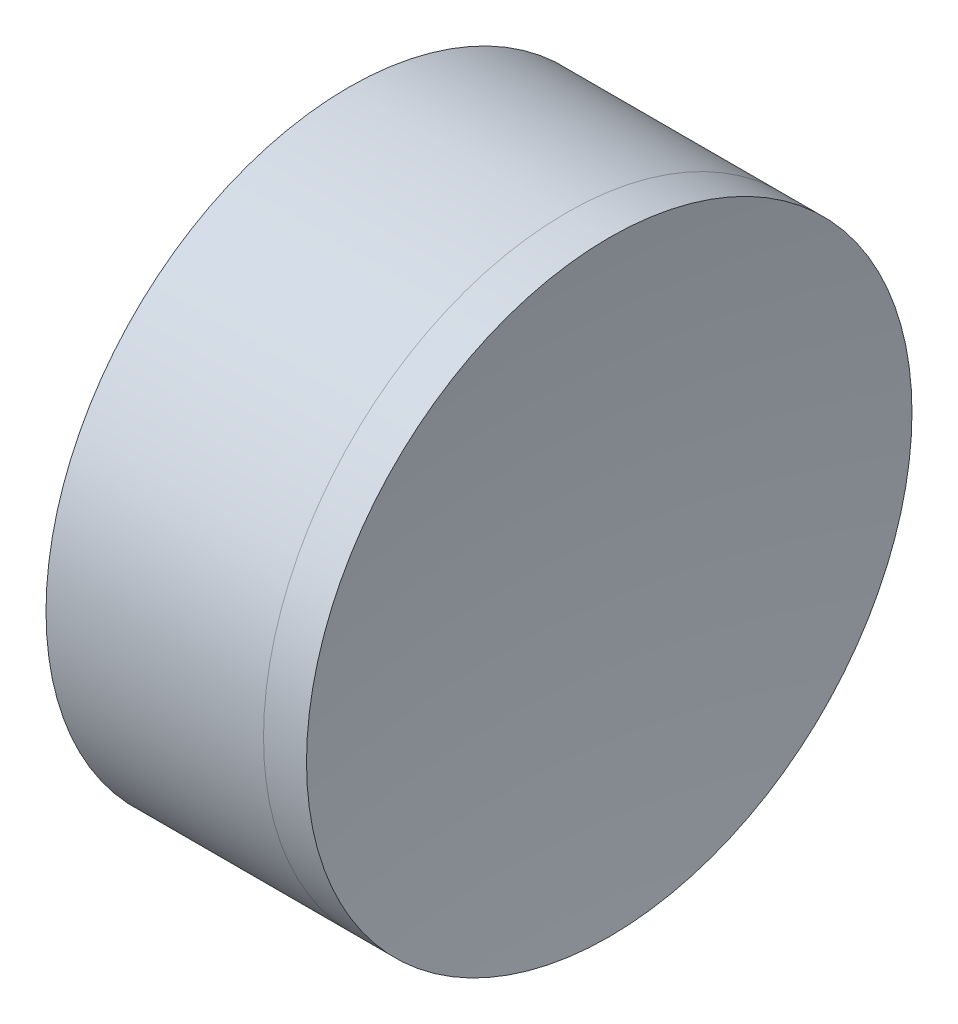
ISO-10303-21;
HEADER;
FILE_DESCRIPTION(('STEP AP214'),'2;1');
FILE_NAME('part.step','',(''),(''),'','','');
FILE_SCHEMA(('AUTOMOTIVE_DESIGN { 1 0 10303 214 1 1 1 1 }'));
ENDSEC;
DATA;
#1=APPLICATION_CONTEXT('core data for automotive mechanical design processes');
#2=APPLICATION_PROTOCOL_DEFINITION('international standard','automotive_design',2000,#1);
#3=PRODUCT_CONTEXT('',#1,'mechanical');
#4=PRODUCT('Part','Part','',(#3));
#5=PRODUCT_RELATED_PRODUCT_CATEGORY('part','',(#4));
#6=PRODUCT_DEFINITION_FORMATION('','',#4);
#7=PRODUCT_DEFINITION_CONTEXT('part definition',#1,'design');
#8=PRODUCT_DEFINITION('design','',#6,#7);
#9=PRODUCT_DEFINITION_SHAPE('','',#8);
#10=(LENGTH_UNIT() NAMED_UNIT(*) SI_UNIT(.MILLI.,.METRE.));
#11=(NAMED_UNIT(*) PLANE_ANGLE_UNIT() SI_UNIT($,.RADIAN.));
#12=(NAMED_UNIT(*) SI_UNIT($,.STERADIAN.) SOLID_ANGLE_UNIT());
#13=UNCERTAINTY_MEASURE_WITH_UNIT(LENGTH_MEASURE(1.E-05),#10,'distance_accuracy_value','');
#14=(GEOMETRIC_REPRESENTATION_CONTEXT(3) GLOBAL_UNCERTAINTY_ASSIGNED_CONTEXT((#13)) GLOBAL_UNIT_ASSIGNED_CONTEXT((#10,
#11,#12)) REPRESENTATION_CONTEXT('',''));
#15=CARTESIAN_POINT('',(0.,0.,0.));
#16=DIRECTION('',(0.,0.,1.));
#17=DIRECTION('',(1.,0.,0.));
#18=AXIS2_PLACEMENT_3D('',#15,#16,#17);
#19=CARTESIAN_POINT('',(258.606408040805,0.,0.));
#20=DIRECTION('',(-1.,0.,0.));
#21=DIRECTION('',(0.,0.,1.));
#22=AXIS2_PLACEMENT_3D('',#19,#20,#21);
#23=SPHERICAL_SURFACE('',#22,24.89);
#24=CARTESIAN_POINT('',(237.082883701143,0.,0.));
#25=DIRECTION('',(-1.,0.,0.));
#26=DIRECTION('',(0.,0.,1.));
#27=AXIS2_PLACEMENT_3D('',#24,#25,#26);
#28=CIRCLE('',#27,12.5);
#29=CARTESIAN_POINT('',(237.082883701143,0.,12.5));
#30=VERTEX_POINT('',#29);
#31=EDGE_CURVE('E11',#30,#30,#28,.T.);
#32=ORIENTED_EDGE('',*,*,#31,.T.);
#33=EDGE_LOOP('',(#32));
#34=FACE_BOUND('',#33,.T.);
#35=ADVANCED_FACE('F45',(#34),#23,.T.);
#36=CARTESIAN_POINT('',(228.102028768971,0.,0.));
#37=DIRECTION('',(-1.,0.,0.));
#38=DIRECTION('',(0.,0.,1.));
#39=AXIS2_PLACEMENT_3D('',#36,#37,#38);
#40=CYLINDRICAL_SURFACE('',#39,12.5);
#41=CARTESIAN_POINT('',(238.857154578056,0.,0.));
#42=DIRECTION('',(-1.,0.,0.));
#43=DIRECTION('',(0.,0.,1.));
#44=AXIS2_PLACEMENT_3D('',#41,#42,#43);
#45=CIRCLE('',#44,12.5);
#46=CARTESIAN_POINT('',(238.857154578056,0.,12.5));
#47=VERTEX_POINT('',#46);
#48=EDGE_CURVE('E51',#47,#47,#45,.T.);
#49=ORIENTED_EDGE('',*,*,#48,.T.);
#50=EDGE_LOOP('',(#49));
#51=FACE_BOUND('',#50,.T.);
#52=ORIENTED_EDGE('',*,*,#31,.F.);
#53=EDGE_LOOP('',(#52));
#54=FACE_BOUND('',#53,.T.);
#55=ADVANCED_FACE('F57',(#51,#54),#40,.T.);
#56=CARTESIAN_POINT('',(323.246408040805,0.,0.));
#57=DIRECTION('',(-1.,0.,0.));
#58=DIRECTION('',(0.,0.,-1.));
#59=AXIS2_PLACEMENT_3D('',#56,#57,#58);
#60=SPHERICAL_SURFACE('',#59,85.31);
#61=ORIENTED_EDGE('',*,*,#48,.F.);
#62=EDGE_LOOP('',(#61));
#63=FACE_BOUND('',#62,.T.);
#64=ADVANCED_FACE('F60',(#63),#60,.F.);
#65=CLOSED_SHELL('',(#35,#55,#64));
#66=MANIFOLD_SOLID_BREP('B2',#65);
#67=CARTESIAN_POINT('',(199.526408040805,0.,0.));
#68=DIRECTION('',(-1.,0.,0.));
#69=DIRECTION('',(0.,0.,1.));
#70=AXIS2_PLACEMENT_3D('',#67,#68,#69);
#71=SPHERICAL_SURFACE('',#70,31.19);
#72=CARTESIAN_POINT('',(228.102028768971,0.,0.));
#73=DIRECTION('',(-1.,0.,0.));
#74=DIRECTION('',(0.,0.,1.));
#75=AXIS2_PLACEMENT_3D('',#72,#73,#74);
#76=CIRCLE('',#75,12.5);
#77=CARTESIAN_POINT('',(228.102028768971,0.,12.5));
#78=VERTEX_POINT('',#77);
#79=EDGE_CURVE('E44',#78,#78,#76,.T.);
#80=ORIENTED_EDGE('',*,*,#79,.T.);
#81=EDGE_LOOP('',(#80));
#82=FACE_BOUND('',#81,.T.);
#83=ADVANCED_FACE('F86',(#82),#71,.F.);
#84=CARTESIAN_POINT('',(-0.816062176165804,0.,0.));
#85=DIRECTION('',(-1.,0.,0.));
#86=DIRECTION('',(0.,0.,1.));
#87=AXIS2_PLACEMENT_3D('',#84,#85,#86);
#88=CYLINDRICAL_SURFACE('',#87,12.5);
#89=CARTESIAN_POINT('',(237.082883701143,0.,0.));
#90=DIRECTION('',(-1.,0.,0.));
#91=DIRECTION('',(0.,0.,1.));
#92=AXIS2_PLACEMENT_3D('',#89,#90,#91);
#93=CIRCLE('',#92,12.5);
#94=CARTESIAN_POINT('',(237.082883701143,0.,12.5));
#95=VERTEX_POINT('',#94);
#96=EDGE_CURVE('E92',#95,#95,#93,.T.);
#97=ORIENTED_EDGE('',*,*,#96,.T.);
#98=EDGE_LOOP('',(#97));
#99=FACE_BOUND('',#98,.T.);
#100=ORIENTED_EDGE('',*,*,#79,.F.);
#101=EDGE_LOOP('',(#100));
#102=FACE_BOUND('',#101,.T.);
#103=ADVANCED_FACE('F98',(#99,#102),#88,.T.);
#104=CARTESIAN_POINT('',(258.606408040805,0.,0.));
#105=DIRECTION('',(-1.,0.,0.));
#106=DIRECTION('',(0.,0.,-1.));
#107=AXIS2_PLACEMENT_3D('',#104,#105,#106);
#108=SPHERICAL_SURFACE('',#107,24.89);
#109=ORIENTED_EDGE('',*,*,#96,.F.);
#110=EDGE_LOOP('',(#109));
#111=FACE_BOUND('',#110,.T.);
#112=ADVANCED_FACE('F101',(#111),#108,.F.);
#113=CLOSED_SHELL('',(#83,#103,#112));
#114=MANIFOLD_SOLID_BREP('B6',#113);
#115=ADVANCED_BREP_SHAPE_REPRESENTATION('',(#18,#66,#114),#14);
#116=SHAPE_DEFINITION_REPRESENTATION(#9,#115);
ENDSEC;
END-ISO-10303-21;
